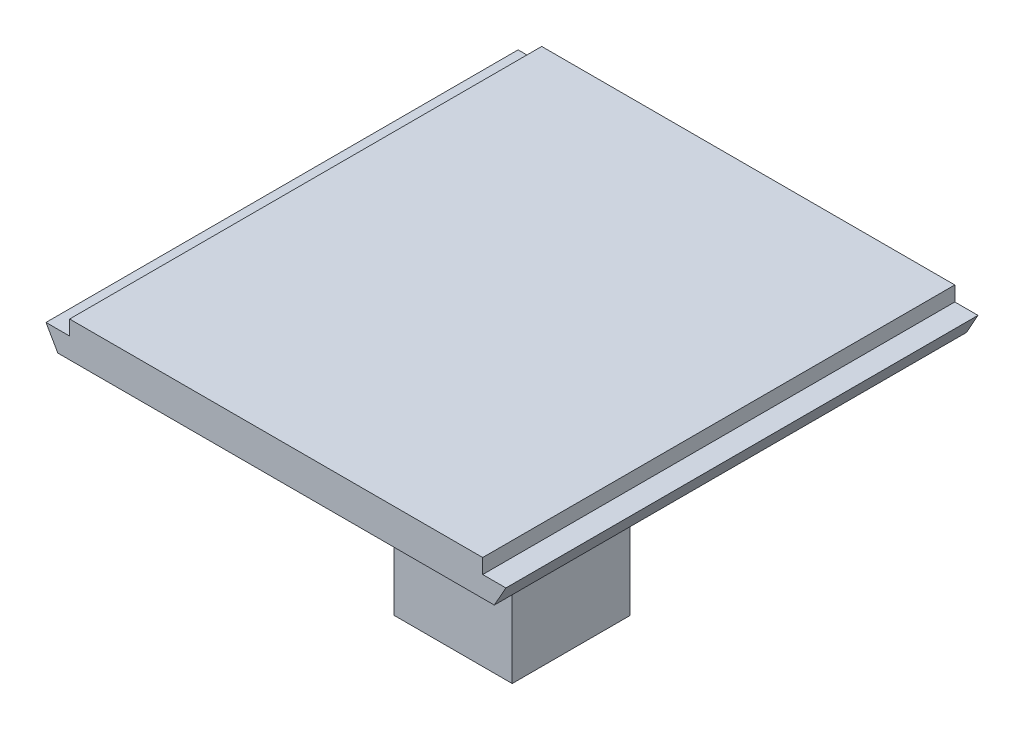
ISO-10303-21;
HEADER;
FILE_DESCRIPTION(('STEP AP214'),'2;1');
FILE_NAME('part.step','',(''),(''),'','','');
FILE_SCHEMA(('AUTOMOTIVE_DESIGN { 1 0 10303 214 1 1 1 1 }'));
ENDSEC;
DATA;
#1=APPLICATION_CONTEXT('core data for automotive mechanical design processes');
#2=APPLICATION_PROTOCOL_DEFINITION('international standard','automotive_design',2000,#1);
#3=PRODUCT_CONTEXT('',#1,'mechanical');
#4=PRODUCT('Part','Part','',(#3));
#5=PRODUCT_RELATED_PRODUCT_CATEGORY('part','',(#4));
#6=PRODUCT_DEFINITION_FORMATION('','',#4);
#7=PRODUCT_DEFINITION_CONTEXT('part definition',#1,'design');
#8=PRODUCT_DEFINITION('design','',#6,#7);
#9=PRODUCT_DEFINITION_SHAPE('','',#8);
#10=(LENGTH_UNIT() NAMED_UNIT(*) SI_UNIT(.MILLI.,.METRE.));
#11=(NAMED_UNIT(*) PLANE_ANGLE_UNIT() SI_UNIT($,.RADIAN.));
#12=(NAMED_UNIT(*) SI_UNIT($,.STERADIAN.) SOLID_ANGLE_UNIT());
#13=UNCERTAINTY_MEASURE_WITH_UNIT(LENGTH_MEASURE(1.E-05),#10,'distance_accuracy_value','');
#14=(GEOMETRIC_REPRESENTATION_CONTEXT(3) GLOBAL_UNCERTAINTY_ASSIGNED_CONTEXT((#13)) GLOBAL_UNIT_ASSIGNED_CONTEXT((#10,
#11,#12)) REPRESENTATION_CONTEXT('',''));
#15=CARTESIAN_POINT('',(0.,0.,0.));
#16=DIRECTION('',(0.,0.,1.));
#17=DIRECTION('',(1.,0.,0.));
#18=AXIS2_PLACEMENT_3D('',#15,#16,#17);
#19=CARTESIAN_POINT('',(69.85,0.,25.4));
#20=DIRECTION('',(0.,1.,0.));
#21=DIRECTION('',(0.,0.,1.));
#22=AXIS2_PLACEMENT_3D('',#19,#20,#21);
#23=PLANE('',#22);
#24=DIRECTION('',(1.,0.,0.));
#25=VECTOR('',#24,1.);
#26=CARTESIAN_POINT('',(-12.7,0.,-12.7));
#27=LINE('',#26,#25);
#28=CARTESIAN_POINT('',(-12.7,0.,-12.7));
#29=VERTEX_POINT('',#28);
#30=CARTESIAN_POINT('',(12.7,0.,-12.7));
#31=VERTEX_POINT('',#30);
#32=EDGE_CURVE('E335',#29,#31,#27,.T.);
#33=ORIENTED_EDGE('',*,*,#32,.F.);
#34=DIRECTION('',(0.,0.,-1.));
#35=VECTOR('',#34,1.);
#36=CARTESIAN_POINT('',(-12.7,0.,12.7));
#37=LINE('',#36,#35);
#38=CARTESIAN_POINT('',(-12.7,0.,12.7));
#39=VERTEX_POINT('',#38);
#40=EDGE_CURVE('E324',#39,#29,#37,.T.);
#41=ORIENTED_EDGE('',*,*,#40,.F.);
#42=DIRECTION('',(1.,0.,0.));
#43=VECTOR('',#42,1.);
#44=CARTESIAN_POINT('',(-12.7,0.,12.7));
#45=LINE('',#44,#43);
#46=CARTESIAN_POINT('',(12.7,0.,12.7));
#47=VERTEX_POINT('',#46);
#48=EDGE_CURVE('E329',#39,#47,#45,.T.);
#49=ORIENTED_EDGE('',*,*,#48,.T.);
#50=DIRECTION('',(0.,0.,-1.));
#51=VECTOR('',#50,1.);
#52=CARTESIAN_POINT('',(12.7,0.,12.7));
#53=LINE('',#52,#51);
#54=EDGE_CURVE('E332',#47,#31,#53,.T.);
#55=ORIENTED_EDGE('',*,*,#54,.T.);
#56=EDGE_LOOP('',(#33,#41,#49,#55));
#57=FACE_BOUND('',#56,.T.);
#58=DIRECTION('',(0.,0.,1.));
#59=VECTOR('',#58,1.);
#60=CARTESIAN_POINT('',(-46.99,0.,-50.8));
#61=LINE('',#60,#59);
#62=CARTESIAN_POINT('',(-46.99,0.,-50.8));
#63=VERTEX_POINT('',#62);
#64=CARTESIAN_POINT('',(-46.99,0.,50.8));
#65=VERTEX_POINT('',#64);
#66=EDGE_CURVE('E239',#63,#65,#61,.T.);
#67=ORIENTED_EDGE('',*,*,#66,.F.);
#68=DIRECTION('',(1.,0.,0.));
#69=VECTOR('',#68,1.);
#70=CARTESIAN_POINT('',(-69.85,0.,-50.8));
#71=LINE('',#70,#69);
#72=CARTESIAN_POINT('',(46.9454662749638,0.,-50.8));
#73=VERTEX_POINT('',#72);
#74=EDGE_CURVE('E150',#63,#73,#71,.T.);
#75=ORIENTED_EDGE('',*,*,#74,.T.);
#76=DIRECTION('',(0.,0.,1.));
#77=VECTOR('',#76,1.);
#78=CARTESIAN_POINT('',(46.9454662749638,0.,-50.8));
#79=LINE('',#78,#77);
#80=CARTESIAN_POINT('',(46.9454662749638,0.,50.8));
#81=VERTEX_POINT('',#80);
#82=EDGE_CURVE('E359',#73,#81,#79,.T.);
#83=ORIENTED_EDGE('',*,*,#82,.T.);
#84=DIRECTION('',(1.,0.,0.));
#85=VECTOR('',#84,1.);
#86=CARTESIAN_POINT('',(-69.85,0.,50.8));
#87=LINE('',#86,#85);
#88=EDGE_CURVE('E252',#65,#81,#87,.T.);
#89=ORIENTED_EDGE('',*,*,#88,.F.);
#90=EDGE_LOOP('',(#67,#75,#83,#89));
#91=FACE_BOUND('',#90,.T.);
#92=ADVANCED_FACE('F146',(#57,#91),#23,.F.);
#93=CARTESIAN_POINT('',(-69.85,7.62,-50.8));
#94=DIRECTION('',(0.,0.,-1.));
#95=DIRECTION('',(-1.,0.,0.));
#96=AXIS2_PLACEMENT_3D('',#93,#94,#95);
#97=PLANE('',#96);
#98=ORIENTED_EDGE('',*,*,#74,.F.);
#99=DIRECTION('',(0.496138938356834,-0.868243142124459,0.));
#100=VECTOR('',#99,1.);
#101=CARTESIAN_POINT('',(-49.53,4.445,-50.8));
#102=LINE('',#101,#100);
#103=CARTESIAN_POINT('',(-49.53,4.445,-50.8));
#104=VERTEX_POINT('',#103);
#105=EDGE_CURVE('E236',#104,#63,#102,.T.);
#106=ORIENTED_EDGE('',*,*,#105,.F.);
#107=DIRECTION('',(-1.,0.,0.));
#108=VECTOR('',#107,1.);
#109=CARTESIAN_POINT('',(0.,4.445,-50.8));
#110=LINE('',#109,#108);
#111=CARTESIAN_POINT('',(-44.45,4.445,-50.8));
#112=VERTEX_POINT('',#111);
#113=EDGE_CURVE('E302',#112,#104,#110,.T.);
#114=ORIENTED_EDGE('',*,*,#113,.F.);
#115=DIRECTION('',(0.,1.,0.));
#116=VECTOR('',#115,1.);
#117=CARTESIAN_POINT('',(-44.45,4.445,-50.8));
#118=LINE('',#117,#116);
#119=CARTESIAN_POINT('',(-44.45,7.62,-50.8));
#120=VERTEX_POINT('',#119);
#121=EDGE_CURVE('E266',#112,#120,#118,.T.);
#122=ORIENTED_EDGE('',*,*,#121,.T.);
#123=DIRECTION('',(1.,0.,0.));
#124=VECTOR('',#123,1.);
#125=CARTESIAN_POINT('',(-69.85,7.62,-50.8));
#126=LINE('',#125,#124);
#127=CARTESIAN_POINT('',(44.45,7.62,-50.8));
#128=VERTEX_POINT('',#127);
#129=EDGE_CURVE('E12',#120,#128,#126,.T.);
#130=ORIENTED_EDGE('',*,*,#129,.T.);
#131=DIRECTION('',(0.,1.,0.));
#132=VECTOR('',#131,1.);
#133=CARTESIAN_POINT('',(44.45,4.445,-50.8));
#134=LINE('',#133,#132);
#135=CARTESIAN_POINT('',(44.45,4.445,-50.8));
#136=VERTEX_POINT('',#135);
#137=EDGE_CURVE('E269',#136,#128,#134,.T.);
#138=ORIENTED_EDGE('',*,*,#137,.F.);
#139=DIRECTION('',(-1.,0.,0.));
#140=VECTOR('',#139,1.);
#141=CARTESIAN_POINT('',(0.,4.445,-50.8));
#142=LINE('',#141,#140);
#143=CARTESIAN_POINT('',(49.4409325499277,4.445,-50.8));
#144=VERTEX_POINT('',#143);
#145=EDGE_CURVE('E281',#144,#136,#142,.T.);
#146=ORIENTED_EDGE('',*,*,#145,.F.);
#147=DIRECTION('',(-0.489538885222494,-0.871981467609901,0.));
#148=VECTOR('',#147,1.);
#149=CARTESIAN_POINT('',(49.4409325499277,4.445,-50.8));
#150=LINE('',#149,#148);
#151=EDGE_CURVE('E164',#144,#73,#150,.T.);
#152=ORIENTED_EDGE('',*,*,#151,.T.);
#153=EDGE_LOOP('',(#98,#106,#114,#122,#130,#138,#146,#152));
#154=FACE_BOUND('',#153,.T.);
#155=ADVANCED_FACE('F255',(#154),#97,.T.);
#156=CARTESIAN_POINT('',(-69.85,7.62,50.8));
#157=DIRECTION('',(0.,0.,-1.));
#158=DIRECTION('',(-1.,0.,0.));
#159=AXIS2_PLACEMENT_3D('',#156,#157,#158);
#160=PLANE('',#159);
#161=DIRECTION('',(0.496138938356834,-0.868243142124459,0.));
#162=VECTOR('',#161,1.);
#163=CARTESIAN_POINT('',(-49.53,4.445,50.8));
#164=LINE('',#163,#162);
#165=CARTESIAN_POINT('',(-49.53,4.445,50.8));
#166=VERTEX_POINT('',#165);
#167=EDGE_CURVE('E172',#166,#65,#164,.T.);
#168=ORIENTED_EDGE('',*,*,#167,.T.);
#169=ORIENTED_EDGE('',*,*,#88,.T.);
#170=DIRECTION('',(-0.489538885222494,-0.871981467609901,0.));
#171=VECTOR('',#170,1.);
#172=CARTESIAN_POINT('',(49.4409325499277,4.445,50.8));
#173=LINE('',#172,#171);
#174=CARTESIAN_POINT('',(49.4409325499277,4.445,50.8));
#175=VERTEX_POINT('',#174);
#176=EDGE_CURVE('E353',#175,#81,#173,.T.);
#177=ORIENTED_EDGE('',*,*,#176,.F.);
#178=DIRECTION('',(1.,0.,0.));
#179=VECTOR('',#178,1.);
#180=CARTESIAN_POINT('',(0.,4.445,50.8));
#181=LINE('',#180,#179);
#182=CARTESIAN_POINT('',(44.45,4.445,50.8));
#183=VERTEX_POINT('',#182);
#184=EDGE_CURVE('E273',#183,#175,#181,.T.);
#185=ORIENTED_EDGE('',*,*,#184,.F.);
#186=DIRECTION('',(0.,1.,0.));
#187=VECTOR('',#186,1.);
#188=CARTESIAN_POINT('',(44.45,4.445,50.8));
#189=LINE('',#188,#187);
#190=CARTESIAN_POINT('',(44.45,7.62,50.8));
#191=VERTEX_POINT('',#190);
#192=EDGE_CURVE('E272',#183,#191,#189,.T.);
#193=ORIENTED_EDGE('',*,*,#192,.T.);
#194=DIRECTION('',(1.,0.,0.));
#195=VECTOR('',#194,1.);
#196=CARTESIAN_POINT('',(-69.85,7.62,50.8));
#197=LINE('',#196,#195);
#198=CARTESIAN_POINT('',(-44.45,7.62,50.8));
#199=VERTEX_POINT('',#198);
#200=EDGE_CURVE('E156',#199,#191,#197,.T.);
#201=ORIENTED_EDGE('',*,*,#200,.F.);
#202=DIRECTION('',(0.,1.,0.));
#203=VECTOR('',#202,1.);
#204=CARTESIAN_POINT('',(-44.45,4.445,50.8));
#205=LINE('',#204,#203);
#206=CARTESIAN_POINT('',(-44.45,4.445,50.8));
#207=VERTEX_POINT('',#206);
#208=EDGE_CURVE('E262',#207,#199,#205,.T.);
#209=ORIENTED_EDGE('',*,*,#208,.F.);
#210=DIRECTION('',(1.,0.,0.));
#211=VECTOR('',#210,1.);
#212=CARTESIAN_POINT('',(0.,4.445,50.8));
#213=LINE('',#212,#211);
#214=EDGE_CURVE('E294',#166,#207,#213,.T.);
#215=ORIENTED_EDGE('',*,*,#214,.F.);
#216=EDGE_LOOP('',(#168,#169,#177,#185,#193,#201,#209,#215));
#217=FACE_BOUND('',#216,.T.);
#218=ADVANCED_FACE('F148',(#217),#160,.F.);
#219=CARTESIAN_POINT('',(0.,4.445,0.));
#220=DIRECTION('',(0.,1.,0.));
#221=DIRECTION('',(0.,0.,1.));
#222=AXIS2_PLACEMENT_3D('',#219,#220,#221);
#223=PLANE('',#222);
#224=ORIENTED_EDGE('',*,*,#113,.T.);
#225=DIRECTION('',(0.,0.,1.));
#226=VECTOR('',#225,1.);
#227=CARTESIAN_POINT('',(-49.53,4.445,-50.8));
#228=LINE('',#227,#226);
#229=EDGE_CURVE('E240',#104,#166,#228,.T.);
#230=ORIENTED_EDGE('',*,*,#229,.T.);
#231=ORIENTED_EDGE('',*,*,#214,.T.);
#232=DIRECTION('',(0.,0.,1.));
#233=VECTOR('',#232,1.);
#234=CARTESIAN_POINT('',(-44.45,4.445,0.));
#235=LINE('',#234,#233);
#236=EDGE_CURVE('E299',#112,#207,#235,.T.);
#237=ORIENTED_EDGE('',*,*,#236,.F.);
#238=EDGE_LOOP('',(#224,#230,#231,#237));
#239=FACE_BOUND('',#238,.T.);
#240=ADVANCED_FACE('F370',(#239),#223,.T.);
#241=CARTESIAN_POINT('',(69.85,7.62,25.4));
#242=DIRECTION('',(0.,1.,0.));
#243=DIRECTION('',(0.,0.,1.));
#244=AXIS2_PLACEMENT_3D('',#241,#242,#243);
#245=PLANE('',#244);
#246=ORIENTED_EDGE('',*,*,#129,.F.);
#247=DIRECTION('',(0.,0.,1.));
#248=VECTOR('',#247,1.);
#249=CARTESIAN_POINT('',(-44.45,7.62,0.));
#250=LINE('',#249,#248);
#251=EDGE_CURVE('E277',#120,#199,#250,.T.);
#252=ORIENTED_EDGE('',*,*,#251,.T.);
#253=ORIENTED_EDGE('',*,*,#200,.T.);
#254=DIRECTION('',(0.,0.,1.));
#255=VECTOR('',#254,1.);
#256=CARTESIAN_POINT('',(44.45,7.62,0.));
#257=LINE('',#256,#255);
#258=EDGE_CURVE('E278',#128,#191,#257,.T.);
#259=ORIENTED_EDGE('',*,*,#258,.F.);
#260=EDGE_LOOP('',(#246,#252,#253,#259));
#261=FACE_BOUND('',#260,.T.);
#262=ADVANCED_FACE('F377',(#261),#245,.T.);
#263=CARTESIAN_POINT('',(44.45,4.445,0.));
#264=DIRECTION('',(-1.,0.,0.));
#265=DIRECTION('',(0.,0.,1.));
#266=AXIS2_PLACEMENT_3D('',#263,#264,#265);
#267=PLANE('',#266);
#268=ORIENTED_EDGE('',*,*,#258,.T.);
#269=ORIENTED_EDGE('',*,*,#192,.F.);
#270=DIRECTION('',(0.,0.,1.));
#271=VECTOR('',#270,1.);
#272=CARTESIAN_POINT('',(44.45,4.445,0.));
#273=LINE('',#272,#271);
#274=EDGE_CURVE('E286',#136,#183,#273,.T.);
#275=ORIENTED_EDGE('',*,*,#274,.F.);
#276=ORIENTED_EDGE('',*,*,#137,.T.);
#277=EDGE_LOOP('',(#268,#269,#275,#276));
#278=FACE_BOUND('',#277,.T.);
#279=ADVANCED_FACE('F379',(#278),#267,.F.);
#280=CARTESIAN_POINT('',(0.,4.445,0.));
#281=DIRECTION('',(0.,1.,0.));
#282=DIRECTION('',(0.,0.,1.));
#283=AXIS2_PLACEMENT_3D('',#280,#281,#282);
#284=PLANE('',#283);
#285=DIRECTION('',(0.,0.,1.));
#286=VECTOR('',#285,1.);
#287=CARTESIAN_POINT('',(49.4409325499277,4.445,-50.8));
#288=LINE('',#287,#286);
#289=EDGE_CURVE('E354',#144,#175,#288,.T.);
#290=ORIENTED_EDGE('',*,*,#289,.F.);
#291=ORIENTED_EDGE('',*,*,#145,.T.);
#292=ORIENTED_EDGE('',*,*,#274,.T.);
#293=ORIENTED_EDGE('',*,*,#184,.T.);
#294=EDGE_LOOP('',(#290,#291,#292,#293));
#295=FACE_BOUND('',#294,.T.);
#296=ADVANCED_FACE('F383',(#295),#284,.T.);
#297=CARTESIAN_POINT('',(-44.45,4.445,0.));
#298=DIRECTION('',(-1.,0.,0.));
#299=DIRECTION('',(0.,0.,1.));
#300=AXIS2_PLACEMENT_3D('',#297,#298,#299);
#301=PLANE('',#300);
#302=ORIENTED_EDGE('',*,*,#251,.F.);
#303=ORIENTED_EDGE('',*,*,#121,.F.);
#304=ORIENTED_EDGE('',*,*,#236,.T.);
#305=ORIENTED_EDGE('',*,*,#208,.T.);
#306=EDGE_LOOP('',(#302,#303,#304,#305));
#307=FACE_BOUND('',#306,.T.);
#308=ADVANCED_FACE('F372',(#307),#301,.T.);
#309=CARTESIAN_POINT('',(-12.7,-50.8,-12.7));
#310=DIRECTION('',(0.,0.,1.));
#311=DIRECTION('',(1.,0.,0.));
#312=AXIS2_PLACEMENT_3D('',#309,#310,#311);
#313=PLANE('',#312);
#314=ORIENTED_EDGE('',*,*,#32,.T.);
#315=DIRECTION('',(0.,1.,0.));
#316=VECTOR('',#315,1.);
#317=CARTESIAN_POINT('',(12.7,-50.8,-12.7));
#318=LINE('',#317,#316);
#319=CARTESIAN_POINT('',(12.7,-50.8,-12.7));
#320=VERTEX_POINT('',#319);
#321=EDGE_CURVE('E282',#320,#31,#318,.T.);
#322=ORIENTED_EDGE('',*,*,#321,.F.);
#323=DIRECTION('',(1.,0.,0.));
#324=VECTOR('',#323,1.);
#325=CARTESIAN_POINT('',(-12.7,-50.8,-12.7));
#326=LINE('',#325,#324);
#327=CARTESIAN_POINT('',(-12.7,-50.8,-12.7));
#328=VERTEX_POINT('',#327);
#329=EDGE_CURVE('E328',#328,#320,#326,.T.);
#330=ORIENTED_EDGE('',*,*,#329,.F.);
#331=DIRECTION('',(0.,1.,0.));
#332=VECTOR('',#331,1.);
#333=CARTESIAN_POINT('',(-12.7,-50.8,-12.7));
#334=LINE('',#333,#332);
#335=EDGE_CURVE('E319',#328,#29,#334,.T.);
#336=ORIENTED_EDGE('',*,*,#335,.T.);
#337=EDGE_LOOP('',(#314,#322,#330,#336));
#338=FACE_BOUND('',#337,.T.);
#339=ADVANCED_FACE('F409',(#338),#313,.F.);
#340=CARTESIAN_POINT('',(12.7,-50.8,12.7));
#341=DIRECTION('',(1.,0.,0.));
#342=DIRECTION('',(0.,0.,-1.));
#343=AXIS2_PLACEMENT_3D('',#340,#341,#342);
#344=PLANE('',#343);
#345=ORIENTED_EDGE('',*,*,#54,.F.);
#346=DIRECTION('',(0.,1.,0.));
#347=VECTOR('',#346,1.);
#348=CARTESIAN_POINT('',(12.7,-50.8,12.7));
#349=LINE('',#348,#347);
#350=CARTESIAN_POINT('',(12.7,-50.8,12.7));
#351=VERTEX_POINT('',#350);
#352=EDGE_CURVE('E311',#351,#47,#349,.T.);
#353=ORIENTED_EDGE('',*,*,#352,.F.);
#354=DIRECTION('',(0.,0.,-1.));
#355=VECTOR('',#354,1.);
#356=CARTESIAN_POINT('',(12.7,-50.8,12.7));
#357=LINE('',#356,#355);
#358=EDGE_CURVE('E345',#351,#320,#357,.T.);
#359=ORIENTED_EDGE('',*,*,#358,.T.);
#360=ORIENTED_EDGE('',*,*,#321,.T.);
#361=EDGE_LOOP('',(#345,#353,#359,#360));
#362=FACE_BOUND('',#361,.T.);
#363=ADVANCED_FACE('F414',(#362),#344,.T.);
#364=CARTESIAN_POINT('',(-12.7,-50.8,12.7));
#365=DIRECTION('',(0.,0.,1.));
#366=DIRECTION('',(1.,0.,0.));
#367=AXIS2_PLACEMENT_3D('',#364,#365,#366);
#368=PLANE('',#367);
#369=ORIENTED_EDGE('',*,*,#48,.F.);
#370=DIRECTION('',(0.,1.,0.));
#371=VECTOR('',#370,1.);
#372=CARTESIAN_POINT('',(-12.7,-50.8,12.7));
#373=LINE('',#372,#371);
#374=CARTESIAN_POINT('',(-12.7,-50.8,12.7));
#375=VERTEX_POINT('',#374);
#376=EDGE_CURVE('E315',#375,#39,#373,.T.);
#377=ORIENTED_EDGE('',*,*,#376,.F.);
#378=DIRECTION('',(1.,0.,0.));
#379=VECTOR('',#378,1.);
#380=CARTESIAN_POINT('',(-12.7,-50.8,12.7));
#381=LINE('',#380,#379);
#382=EDGE_CURVE('E341',#375,#351,#381,.T.);
#383=ORIENTED_EDGE('',*,*,#382,.T.);
#384=ORIENTED_EDGE('',*,*,#352,.T.);
#385=EDGE_LOOP('',(#369,#377,#383,#384));
#386=FACE_BOUND('',#385,.T.);
#387=ADVANCED_FACE('F418',(#386),#368,.T.);
#388=CARTESIAN_POINT('',(-12.7,-50.8,12.7));
#389=DIRECTION('',(1.,0.,0.));
#390=DIRECTION('',(0.,0.,-1.));
#391=AXIS2_PLACEMENT_3D('',#388,#389,#390);
#392=PLANE('',#391);
#393=ORIENTED_EDGE('',*,*,#40,.T.);
#394=ORIENTED_EDGE('',*,*,#335,.F.);
#395=DIRECTION('',(0.,0.,-1.));
#396=VECTOR('',#395,1.);
#397=CARTESIAN_POINT('',(-12.7,-50.8,12.7));
#398=LINE('',#397,#396);
#399=EDGE_CURVE('E323',#375,#328,#398,.T.);
#400=ORIENTED_EDGE('',*,*,#399,.F.);
#401=ORIENTED_EDGE('',*,*,#376,.T.);
#402=EDGE_LOOP('',(#393,#394,#400,#401));
#403=FACE_BOUND('',#402,.T.);
#404=ADVANCED_FACE('F422',(#403),#392,.F.);
#405=CARTESIAN_POINT('',(0.,-50.8,0.));
#406=DIRECTION('',(0.,1.,0.));
#407=DIRECTION('',(0.,0.,1.));
#408=AXIS2_PLACEMENT_3D('',#405,#406,#407);
#409=PLANE('',#408);
#410=ORIENTED_EDGE('',*,*,#329,.T.);
#411=ORIENTED_EDGE('',*,*,#358,.F.);
#412=ORIENTED_EDGE('',*,*,#382,.F.);
#413=ORIENTED_EDGE('',*,*,#399,.T.);
#414=EDGE_LOOP('',(#410,#411,#412,#413));
#415=FACE_BOUND('',#414,.T.);
#416=ADVANCED_FACE('F390',(#415),#409,.F.);
#417=CARTESIAN_POINT('',(-49.53,4.445,-50.8));
#418=DIRECTION('',(-0.868243142124459,-0.496138938356834,0.));
#419=DIRECTION('',(0.496138938356834,-0.868243142124459,0.));
#420=AXIS2_PLACEMENT_3D('',#417,#418,#419);
#421=PLANE('',#420);
#422=ORIENTED_EDGE('',*,*,#167,.F.);
#423=ORIENTED_EDGE('',*,*,#229,.F.);
#424=ORIENTED_EDGE('',*,*,#105,.T.);
#425=ORIENTED_EDGE('',*,*,#66,.T.);
#426=EDGE_LOOP('',(#422,#423,#424,#425));
#427=FACE_BOUND('',#426,.T.);
#428=ADVANCED_FACE('F238',(#427),#421,.T.);
#429=CARTESIAN_POINT('',(49.4409325499277,4.445,-50.8));
#430=DIRECTION('',(-0.871981467609901,0.489538885222494,0.));
#431=DIRECTION('',(-0.489538885222494,-0.871981467609901,0.));
#432=AXIS2_PLACEMENT_3D('',#429,#430,#431);
#433=PLANE('',#432);
#434=ORIENTED_EDGE('',*,*,#176,.T.);
#435=ORIENTED_EDGE('',*,*,#82,.F.);
#436=ORIENTED_EDGE('',*,*,#151,.F.);
#437=ORIENTED_EDGE('',*,*,#289,.T.);
#438=EDGE_LOOP('',(#434,#435,#436,#437));
#439=FACE_BOUND('',#438,.T.);
#440=ADVANCED_FACE('F384',(#439),#433,.F.);
#441=CLOSED_SHELL('',(#92,#155,#218,#240,#262,#279,#296,#308,#339,#363,#387,#404,#416,#428,#440));
#442=MANIFOLD_SOLID_BREP('B2',#441);
#443=ADVANCED_BREP_SHAPE_REPRESENTATION('',(#18,#442),#14);
#444=SHAPE_DEFINITION_REPRESENTATION(#9,#443);
ENDSEC;
END-ISO-10303-21;
